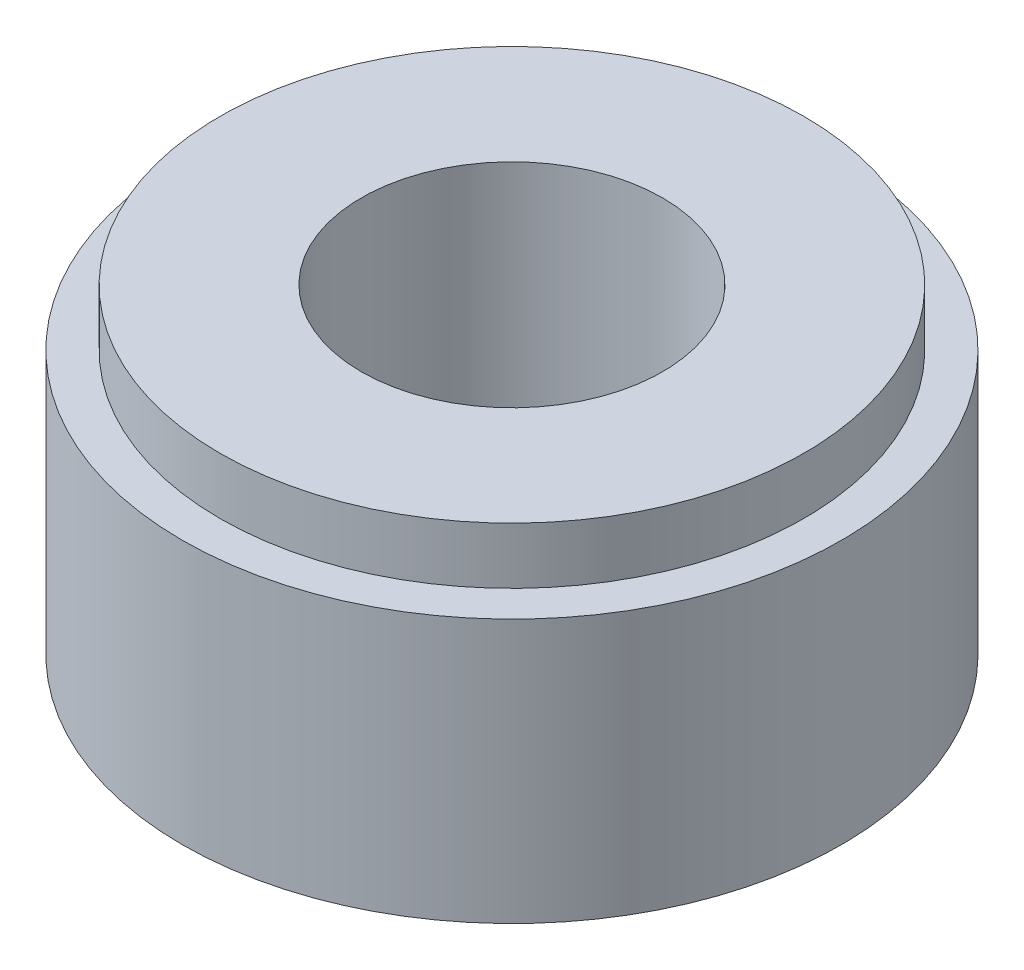
ISO-10303-21;
HEADER;
FILE_DESCRIPTION(('STEP AP214'),'2;1');
FILE_NAME('part.step','',(''),(''),'','','');
FILE_SCHEMA(('AUTOMOTIVE_DESIGN { 1 0 10303 214 1 1 1 1 }'));
ENDSEC;
DATA;
#1=APPLICATION_CONTEXT('core data for automotive mechanical design processes');
#2=APPLICATION_PROTOCOL_DEFINITION('international standard','automotive_design',2000,#1);
#3=PRODUCT_CONTEXT('',#1,'mechanical');
#4=PRODUCT('Part','Part','',(#3));
#5=PRODUCT_RELATED_PRODUCT_CATEGORY('part','',(#4));
#6=PRODUCT_DEFINITION_FORMATION('','',#4);
#7=PRODUCT_DEFINITION_CONTEXT('part definition',#1,'design');
#8=PRODUCT_DEFINITION('design','',#6,#7);
#9=PRODUCT_DEFINITION_SHAPE('','',#8);
#10=(LENGTH_UNIT() NAMED_UNIT(*) SI_UNIT(.MILLI.,.METRE.));
#11=(NAMED_UNIT(*) PLANE_ANGLE_UNIT() SI_UNIT($,.RADIAN.));
#12=(NAMED_UNIT(*) SI_UNIT($,.STERADIAN.) SOLID_ANGLE_UNIT());
#13=UNCERTAINTY_MEASURE_WITH_UNIT(LENGTH_MEASURE(1.E-05),#10,'distance_accuracy_value','');
#14=(GEOMETRIC_REPRESENTATION_CONTEXT(3) GLOBAL_UNCERTAINTY_ASSIGNED_CONTEXT((#13)) GLOBAL_UNIT_ASSIGNED_CONTEXT((#10,
#11,#12)) REPRESENTATION_CONTEXT('',''));
#15=CARTESIAN_POINT('',(0.,0.,0.));
#16=DIRECTION('',(0.,0.,1.));
#17=DIRECTION('',(1.,0.,0.));
#18=AXIS2_PLACEMENT_3D('',#15,#16,#17);
#19=CARTESIAN_POINT('',(0.,14.,0.));
#20=DIRECTION('',(0.,-1.,0.));
#21=DIRECTION('',(0.,0.,-1.));
#22=AXIS2_PLACEMENT_3D('',#19,#20,#21);
#23=CYLINDRICAL_SURFACE('',#22,17.5);
#24=CARTESIAN_POINT('',(0.,14.,0.));
#25=DIRECTION('',(0.,1.,0.));
#26=DIRECTION('',(0.,0.,1.));
#27=AXIS2_PLACEMENT_3D('',#24,#25,#26);
#28=CIRCLE('',#27,17.5);
#29=CARTESIAN_POINT('',(0.,14.,17.5));
#30=VERTEX_POINT('',#29);
#31=EDGE_CURVE('E44',#30,#30,#28,.T.);
#32=ORIENTED_EDGE('',*,*,#31,.F.);
#33=EDGE_LOOP('',(#32));
#34=FACE_BOUND('',#33,.T.);
#35=CARTESIAN_POINT('',(0.,0.,0.));
#36=DIRECTION('',(0.,1.,0.));
#37=DIRECTION('',(0.,0.,1.));
#38=AXIS2_PLACEMENT_3D('',#35,#36,#37);
#39=CIRCLE('',#38,17.5);
#40=CARTESIAN_POINT('',(0.,0.,17.5));
#41=VERTEX_POINT('',#40);
#42=EDGE_CURVE('E40',#41,#41,#39,.T.);
#43=ORIENTED_EDGE('',*,*,#42,.T.);
#44=EDGE_LOOP('',(#43));
#45=FACE_BOUND('',#44,.T.);
#46=ADVANCED_FACE('F37',(#34,#45),#23,.T.);
#47=CARTESIAN_POINT('',(0.,14.,0.));
#48=DIRECTION('',(0.,1.,0.));
#49=DIRECTION('',(0.,0.,1.));
#50=AXIS2_PLACEMENT_3D('',#47,#48,#49);
#51=PLANE('',#50);
#52=CARTESIAN_POINT('',(0.,14.,0.));
#53=DIRECTION('',(0.,1.,0.));
#54=DIRECTION('',(0.,0.,1.));
#55=AXIS2_PLACEMENT_3D('',#52,#53,#54);
#56=CIRCLE('',#55,15.5);
#57=CARTESIAN_POINT('',(0.,14.,15.5));
#58=VERTEX_POINT('',#57);
#59=EDGE_CURVE('E10',#58,#58,#56,.T.);
#60=ORIENTED_EDGE('',*,*,#59,.F.);
#61=EDGE_LOOP('',(#60));
#62=FACE_BOUND('',#61,.T.);
#63=ORIENTED_EDGE('',*,*,#31,.T.);
#64=EDGE_LOOP('',(#63));
#65=FACE_BOUND('',#64,.T.);
#66=ADVANCED_FACE('F82',(#62,#65),#51,.T.);
#67=CARTESIAN_POINT('',(0.,0.,0.));
#68=DIRECTION('',(0.,1.,0.));
#69=DIRECTION('',(0.,0.,1.));
#70=AXIS2_PLACEMENT_3D('',#67,#68,#69);
#71=PLANE('',#70);
#72=CARTESIAN_POINT('',(0.,0.,0.));
#73=DIRECTION('',(0.,1.,0.));
#74=DIRECTION('',(0.,0.,1.));
#75=AXIS2_PLACEMENT_3D('',#72,#73,#74);
#76=CIRCLE('',#75,8.);
#77=CARTESIAN_POINT('',(0.,0.,8.));
#78=VERTEX_POINT('',#77);
#79=EDGE_CURVE('E53',#78,#78,#76,.T.);
#80=ORIENTED_EDGE('',*,*,#79,.T.);
#81=EDGE_LOOP('',(#80));
#82=FACE_BOUND('',#81,.T.);
#83=ORIENTED_EDGE('',*,*,#42,.F.);
#84=EDGE_LOOP('',(#83));
#85=FACE_BOUND('',#84,.T.);
#86=ADVANCED_FACE('F60',(#82,#85),#71,.F.);
#87=CARTESIAN_POINT('',(0.,17.,0.));
#88=DIRECTION('',(0.,-1.,0.));
#89=DIRECTION('',(0.,0.,-1.));
#90=AXIS2_PLACEMENT_3D('',#87,#88,#89);
#91=CYLINDRICAL_SURFACE('',#90,15.5);
#92=CARTESIAN_POINT('',(0.,17.,0.));
#93=DIRECTION('',(0.,1.,0.));
#94=DIRECTION('',(0.,0.,1.));
#95=AXIS2_PLACEMENT_3D('',#92,#93,#94);
#96=CIRCLE('',#95,15.5);
#97=CARTESIAN_POINT('',(0.,17.,15.5));
#98=VERTEX_POINT('',#97);
#99=EDGE_CURVE('E50',#98,#98,#96,.T.);
#100=ORIENTED_EDGE('',*,*,#99,.F.);
#101=EDGE_LOOP('',(#100));
#102=FACE_BOUND('',#101,.T.);
#103=ORIENTED_EDGE('',*,*,#59,.T.);
#104=EDGE_LOOP('',(#103));
#105=FACE_BOUND('',#104,.T.);
#106=ADVANCED_FACE('F72',(#102,#105),#91,.T.);
#107=CARTESIAN_POINT('',(0.,17.,0.));
#108=DIRECTION('',(0.,1.,0.));
#109=DIRECTION('',(0.,0.,1.));
#110=AXIS2_PLACEMENT_3D('',#107,#108,#109);
#111=PLANE('',#110);
#112=CARTESIAN_POINT('',(0.,17.,0.));
#113=DIRECTION('',(0.,1.,0.));
#114=DIRECTION('',(0.,0.,1.));
#115=AXIS2_PLACEMENT_3D('',#112,#113,#114);
#116=CIRCLE('',#115,8.);
#117=CARTESIAN_POINT('',(0.,17.,8.));
#118=VERTEX_POINT('',#117);
#119=EDGE_CURVE('E54',#118,#118,#116,.T.);
#120=ORIENTED_EDGE('',*,*,#119,.F.);
#121=EDGE_LOOP('',(#120));
#122=FACE_BOUND('',#121,.T.);
#123=ORIENTED_EDGE('',*,*,#99,.T.);
#124=EDGE_LOOP('',(#123));
#125=FACE_BOUND('',#124,.T.);
#126=ADVANCED_FACE('F66',(#122,#125),#111,.T.);
#127=CARTESIAN_POINT('',(0.,0.,0.));
#128=DIRECTION('',(0.,1.,0.));
#129=DIRECTION('',(0.,0.,1.));
#130=AXIS2_PLACEMENT_3D('',#127,#128,#129);
#131=CYLINDRICAL_SURFACE('',#130,8.);
#132=ORIENTED_EDGE('',*,*,#79,.F.);
#133=EDGE_LOOP('',(#132));
#134=FACE_BOUND('',#133,.T.);
#135=ORIENTED_EDGE('',*,*,#119,.T.);
#136=EDGE_LOOP('',(#135));
#137=FACE_BOUND('',#136,.T.);
#138=ADVANCED_FACE('F63',(#134,#137),#131,.F.);
#139=CLOSED_SHELL('',(#46,#66,#86,#106,#126,#138));
#140=MANIFOLD_SOLID_BREP('B2',#139);
#141=ADVANCED_BREP_SHAPE_REPRESENTATION('',(#18,#140),#14);
#142=SHAPE_DEFINITION_REPRESENTATION(#9,#141);
ENDSEC;
END-ISO-10303-21;
